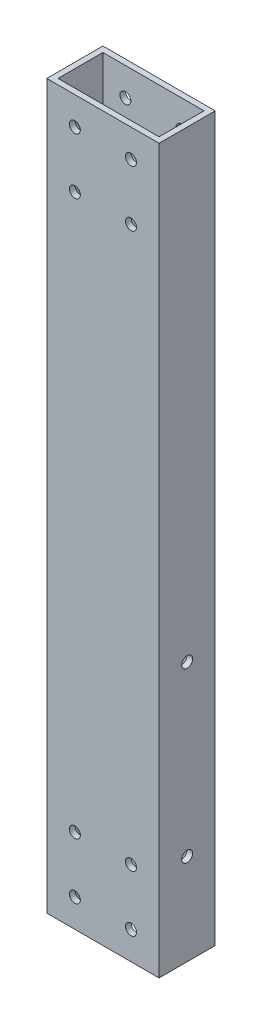
ISO-10303-21;
HEADER;
FILE_DESCRIPTION(('STEP AP214'),'2;1');
FILE_NAME('part.step','',(''),(''),'','','');
FILE_SCHEMA(('AUTOMOTIVE_DESIGN { 1 0 10303 214 1 1 1 1 }'));
ENDSEC;
DATA;
#1=APPLICATION_CONTEXT('core data for automotive mechanical design processes');
#2=APPLICATION_PROTOCOL_DEFINITION('international standard','automotive_design',2000,#1);
#3=PRODUCT_CONTEXT('',#1,'mechanical');
#4=PRODUCT('Part','Part','',(#3));
#5=PRODUCT_RELATED_PRODUCT_CATEGORY('part','',(#4));
#6=PRODUCT_DEFINITION_FORMATION('','',#4);
#7=PRODUCT_DEFINITION_CONTEXT('part definition',#1,'design');
#8=PRODUCT_DEFINITION('design','',#6,#7);
#9=PRODUCT_DEFINITION_SHAPE('','',#8);
#10=(LENGTH_UNIT() NAMED_UNIT(*) SI_UNIT(.MILLI.,.METRE.));
#11=(NAMED_UNIT(*) PLANE_ANGLE_UNIT() SI_UNIT($,.RADIAN.));
#12=(NAMED_UNIT(*) SI_UNIT($,.STERADIAN.) SOLID_ANGLE_UNIT());
#13=UNCERTAINTY_MEASURE_WITH_UNIT(LENGTH_MEASURE(1.E-05),#10,'distance_accuracy_value','');
#14=(GEOMETRIC_REPRESENTATION_CONTEXT(3) GLOBAL_UNCERTAINTY_ASSIGNED_CONTEXT((#13)) GLOBAL_UNIT_ASSIGNED_CONTEXT((#10,
#11,#12)) REPRESENTATION_CONTEXT('',''));
#15=CARTESIAN_POINT('',(0.,0.,0.));
#16=DIRECTION('',(0.,0.,1.));
#17=DIRECTION('',(1.,0.,0.));
#18=AXIS2_PLACEMENT_3D('',#15,#16,#17);
#19=CARTESIAN_POINT('',(0.,163.5125,0.));
#20=DIRECTION('',(0.,1.,0.));
#21=DIRECTION('',(0.,0.,1.));
#22=AXIS2_PLACEMENT_3D('',#19,#20,#21);
#23=PLANE('',#22);
#24=DIRECTION('',(0.,0.,-1.));
#25=VECTOR('',#24,1.);
#26=CARTESIAN_POINT('',(25.4,163.5125,12.7));
#27=LINE('',#26,#25);
#28=CARTESIAN_POINT('',(25.4,163.5125,12.7));
#29=VERTEX_POINT('',#28);
#30=CARTESIAN_POINT('',(25.4,163.5125,-12.7));
#31=VERTEX_POINT('',#30);
#32=EDGE_CURVE('E161',#29,#31,#27,.T.);
#33=ORIENTED_EDGE('',*,*,#32,.T.);
#34=DIRECTION('',(-1.,0.,0.));
#35=VECTOR('',#34,1.);
#36=CARTESIAN_POINT('',(-25.4,163.5125,-12.7));
#37=LINE('',#36,#35);
#38=CARTESIAN_POINT('',(-25.4,163.5125,-12.7));
#39=VERTEX_POINT('',#38);
#40=EDGE_CURVE('E164',#31,#39,#37,.T.);
#41=ORIENTED_EDGE('',*,*,#40,.T.);
#42=DIRECTION('',(0.,0.,1.));
#43=VECTOR('',#42,1.);
#44=CARTESIAN_POINT('',(-25.4,163.5125,12.7));
#45=LINE('',#44,#43);
#46=CARTESIAN_POINT('',(-25.4,163.5125,12.7));
#47=VERTEX_POINT('',#46);
#48=EDGE_CURVE('E167',#39,#47,#45,.T.);
#49=ORIENTED_EDGE('',*,*,#48,.T.);
#50=DIRECTION('',(1.,0.,0.));
#51=VECTOR('',#50,1.);
#52=CARTESIAN_POINT('',(-25.4,163.5125,12.7));
#53=LINE('',#52,#51);
#54=EDGE_CURVE('E169',#47,#29,#53,.T.);
#55=ORIENTED_EDGE('',*,*,#54,.T.);
#56=EDGE_LOOP('',(#33,#41,#49,#55));
#57=FACE_BOUND('',#56,.T.);
#58=DIRECTION('',(-1.,0.,0.));
#59=VECTOR('',#58,1.);
#60=CARTESIAN_POINT('',(0.,163.5125,-10.16));
#61=LINE('',#60,#59);
#62=CARTESIAN_POINT('',(22.86,163.5125,-10.16));
#63=VERTEX_POINT('',#62);
#64=CARTESIAN_POINT('',(-22.86,163.5125,-10.16));
#65=VERTEX_POINT('',#64);
#66=EDGE_CURVE('E131',#63,#65,#61,.T.);
#67=ORIENTED_EDGE('',*,*,#66,.F.);
#68=DIRECTION('',(0.,0.,-1.));
#69=VECTOR('',#68,1.);
#70=CARTESIAN_POINT('',(22.86,163.5125,0.));
#71=LINE('',#70,#69);
#72=CARTESIAN_POINT('',(22.86,163.5125,10.16));
#73=VERTEX_POINT('',#72);
#74=EDGE_CURVE('E123',#73,#63,#71,.T.);
#75=ORIENTED_EDGE('',*,*,#74,.F.);
#76=DIRECTION('',(1.,0.,0.));
#77=VECTOR('',#76,1.);
#78=CARTESIAN_POINT('',(0.,163.5125,10.16));
#79=LINE('',#78,#77);
#80=CARTESIAN_POINT('',(-22.86,163.5125,10.16));
#81=VERTEX_POINT('',#80);
#82=EDGE_CURVE('E145',#81,#73,#79,.T.);
#83=ORIENTED_EDGE('',*,*,#82,.F.);
#84=DIRECTION('',(0.,0.,1.));
#85=VECTOR('',#84,1.);
#86=CARTESIAN_POINT('',(-22.86,163.5125,0.));
#87=LINE('',#86,#85);
#88=EDGE_CURVE('E143',#65,#81,#87,.T.);
#89=ORIENTED_EDGE('',*,*,#88,.F.);
#90=EDGE_LOOP('',(#67,#75,#83,#89));
#91=FACE_BOUND('',#90,.T.);
#92=ADVANCED_FACE('F56',(#57,#91),#23,.T.);
#93=CARTESIAN_POINT('',(0.,-163.5125,0.));
#94=DIRECTION('',(0.,1.,0.));
#95=DIRECTION('',(0.,0.,1.));
#96=AXIS2_PLACEMENT_3D('',#93,#94,#95);
#97=PLANE('',#96);
#98=DIRECTION('',(0.,0.,-1.));
#99=VECTOR('',#98,1.);
#100=CARTESIAN_POINT('',(25.4,-163.5125,12.7));
#101=LINE('',#100,#99);
#102=CARTESIAN_POINT('',(25.4,-163.5125,12.7));
#103=VERTEX_POINT('',#102);
#104=CARTESIAN_POINT('',(25.4,-163.5125,-12.7));
#105=VERTEX_POINT('',#104);
#106=EDGE_CURVE('E139',#103,#105,#101,.T.);
#107=ORIENTED_EDGE('',*,*,#106,.F.);
#108=DIRECTION('',(1.,0.,0.));
#109=VECTOR('',#108,1.);
#110=CARTESIAN_POINT('',(-25.4,-163.5125,12.7));
#111=LINE('',#110,#109);
#112=CARTESIAN_POINT('',(-25.4,-163.5125,12.7));
#113=VERTEX_POINT('',#112);
#114=EDGE_CURVE('E165',#113,#103,#111,.T.);
#115=ORIENTED_EDGE('',*,*,#114,.F.);
#116=DIRECTION('',(0.,0.,1.));
#117=VECTOR('',#116,1.);
#118=CARTESIAN_POINT('',(-25.4,-163.5125,12.7));
#119=LINE('',#118,#117);
#120=CARTESIAN_POINT('',(-25.4,-163.5125,-12.7));
#121=VERTEX_POINT('',#120);
#122=EDGE_CURVE('E176',#121,#113,#119,.T.);
#123=ORIENTED_EDGE('',*,*,#122,.F.);
#124=DIRECTION('',(-1.,0.,0.));
#125=VECTOR('',#124,1.);
#126=CARTESIAN_POINT('',(-25.4,-163.5125,-12.7));
#127=LINE('',#126,#125);
#128=EDGE_CURVE('E174',#105,#121,#127,.T.);
#129=ORIENTED_EDGE('',*,*,#128,.F.);
#130=EDGE_LOOP('',(#107,#115,#123,#129));
#131=FACE_BOUND('',#130,.T.);
#132=DIRECTION('',(0.,0.,-1.));
#133=VECTOR('',#132,1.);
#134=CARTESIAN_POINT('',(22.86,-163.5125,0.));
#135=LINE('',#134,#133);
#136=CARTESIAN_POINT('',(22.86,-163.5125,10.16));
#137=VERTEX_POINT('',#136);
#138=CARTESIAN_POINT('',(22.86,-163.5125,-10.16));
#139=VERTEX_POINT('',#138);
#140=EDGE_CURVE('E81',#137,#139,#135,.T.);
#141=ORIENTED_EDGE('',*,*,#140,.T.);
#142=DIRECTION('',(-1.,0.,0.));
#143=VECTOR('',#142,1.);
#144=CARTESIAN_POINT('',(0.,-163.5125,-10.16));
#145=LINE('',#144,#143);
#146=CARTESIAN_POINT('',(-22.86,-163.5125,-10.16));
#147=VERTEX_POINT('',#146);
#148=EDGE_CURVE('E138',#139,#147,#145,.T.);
#149=ORIENTED_EDGE('',*,*,#148,.T.);
#150=DIRECTION('',(0.,0.,1.));
#151=VECTOR('',#150,1.);
#152=CARTESIAN_POINT('',(-22.86,-163.5125,0.));
#153=LINE('',#152,#151);
#154=CARTESIAN_POINT('',(-22.86,-163.5125,10.16));
#155=VERTEX_POINT('',#154);
#156=EDGE_CURVE('E153',#147,#155,#153,.T.);
#157=ORIENTED_EDGE('',*,*,#156,.T.);
#158=DIRECTION('',(1.,0.,0.));
#159=VECTOR('',#158,1.);
#160=CARTESIAN_POINT('',(0.,-163.5125,10.16));
#161=LINE('',#160,#159);
#162=EDGE_CURVE('E132',#155,#137,#161,.T.);
#163=ORIENTED_EDGE('',*,*,#162,.T.);
#164=EDGE_LOOP('',(#141,#149,#157,#163));
#165=FACE_BOUND('',#164,.T.);
#166=ADVANCED_FACE('F252',(#131,#165),#97,.F.);
#167=CARTESIAN_POINT('',(25.4,163.5125,12.7));
#168=DIRECTION('',(-1.,0.,0.));
#169=DIRECTION('',(0.,0.,1.));
#170=AXIS2_PLACEMENT_3D('',#167,#168,#169);
#171=PLANE('',#170);
#172=CARTESIAN_POINT('',(25.4,-46.0374999999954,0.));
#173=DIRECTION('',(1.,0.,0.));
#174=DIRECTION('',(0.,0.,-1.));
#175=AXIS2_PLACEMENT_3D('',#172,#173,#174);
#176=CIRCLE('',#175,2.4765);
#177=CARTESIAN_POINT('',(25.4,-46.0374999999954,-2.47649999999999));
#178=VERTEX_POINT('',#177);
#179=EDGE_CURVE('E446',#178,#178,#176,.T.);
#180=ORIENTED_EDGE('',*,*,#179,.F.);
#181=EDGE_LOOP('',(#180));
#182=FACE_BOUND('',#181,.T.);
#183=CARTESIAN_POINT('',(25.4,-122.237499999995,0.));
#184=DIRECTION('',(1.,0.,0.));
#185=DIRECTION('',(0.,0.,-1.));
#186=AXIS2_PLACEMENT_3D('',#183,#184,#185);
#187=CIRCLE('',#186,2.47649999999999);
#188=CARTESIAN_POINT('',(25.4,-122.237499999995,-2.47649999999998));
#189=VERTEX_POINT('',#188);
#190=EDGE_CURVE('E440',#189,#189,#187,.T.);
#191=ORIENTED_EDGE('',*,*,#190,.F.);
#192=EDGE_LOOP('',(#191));
#193=FACE_BOUND('',#192,.T.);
#194=ORIENTED_EDGE('',*,*,#106,.T.);
#195=DIRECTION('',(0.,-1.,0.));
#196=VECTOR('',#195,1.);
#197=CARTESIAN_POINT('',(25.4,163.5125,-12.7));
#198=LINE('',#197,#196);
#199=EDGE_CURVE('E12',#31,#105,#198,.T.);
#200=ORIENTED_EDGE('',*,*,#199,.F.);
#201=ORIENTED_EDGE('',*,*,#32,.F.);
#202=DIRECTION('',(0.,-1.,0.));
#203=VECTOR('',#202,1.);
#204=CARTESIAN_POINT('',(25.4,163.5125,12.7));
#205=LINE('',#204,#203);
#206=EDGE_CURVE('E171',#29,#103,#205,.T.);
#207=ORIENTED_EDGE('',*,*,#206,.T.);
#208=EDGE_LOOP('',(#194,#200,#201,#207));
#209=FACE_BOUND('',#208,.T.);
#210=ADVANCED_FACE('F58',(#182,#193,#209),#171,.F.);
#211=CARTESIAN_POINT('',(-25.4,163.5125,-12.7));
#212=DIRECTION('',(0.,0.,1.));
#213=DIRECTION('',(1.,0.,0.));
#214=AXIS2_PLACEMENT_3D('',#211,#212,#213);
#215=PLANE('',#214);
#216=CARTESIAN_POINT('',(12.7,150.8125,-12.7));
#217=DIRECTION('',(0.,0.,1.));
#218=DIRECTION('',(1.,0.,0.));
#219=AXIS2_PLACEMENT_3D('',#216,#217,#218);
#220=CIRCLE('',#219,2.47650000000001);
#221=CARTESIAN_POINT('',(15.1765,150.8125,-12.7));
#222=VERTEX_POINT('',#221);
#223=EDGE_CURVE('E289',#222,#222,#220,.T.);
#224=ORIENTED_EDGE('',*,*,#223,.T.);
#225=EDGE_LOOP('',(#224));
#226=FACE_BOUND('',#225,.T.);
#227=CARTESIAN_POINT('',(-12.7,-150.8125,-12.7));
#228=DIRECTION('',(0.,0.,1.));
#229=DIRECTION('',(1.,0.,0.));
#230=AXIS2_PLACEMENT_3D('',#227,#228,#229);
#231=CIRCLE('',#230,2.47650000000001);
#232=CARTESIAN_POINT('',(-10.2235,-150.8125,-12.7));
#233=VERTEX_POINT('',#232);
#234=EDGE_CURVE('E293',#233,#233,#231,.T.);
#235=ORIENTED_EDGE('',*,*,#234,.T.);
#236=EDGE_LOOP('',(#235));
#237=FACE_BOUND('',#236,.T.);
#238=CARTESIAN_POINT('',(12.7,-150.8125,-12.7));
#239=DIRECTION('',(0.,0.,1.));
#240=DIRECTION('',(1.,0.,0.));
#241=AXIS2_PLACEMENT_3D('',#238,#239,#240);
#242=CIRCLE('',#241,2.47650000000001);
#243=CARTESIAN_POINT('',(15.1765,-150.8125,-12.7));
#244=VERTEX_POINT('',#243);
#245=EDGE_CURVE('E297',#244,#244,#242,.T.);
#246=ORIENTED_EDGE('',*,*,#245,.T.);
#247=EDGE_LOOP('',(#246));
#248=FACE_BOUND('',#247,.T.);
#249=CARTESIAN_POINT('',(12.7,-125.4125,-12.7));
#250=DIRECTION('',(0.,0.,1.));
#251=DIRECTION('',(1.,0.,0.));
#252=AXIS2_PLACEMENT_3D('',#249,#250,#251);
#253=CIRCLE('',#252,2.4765);
#254=CARTESIAN_POINT('',(15.1765,-125.4125,-12.7));
#255=VERTEX_POINT('',#254);
#256=EDGE_CURVE('E301',#255,#255,#253,.T.);
#257=ORIENTED_EDGE('',*,*,#256,.T.);
#258=EDGE_LOOP('',(#257));
#259=FACE_BOUND('',#258,.T.);
#260=CARTESIAN_POINT('',(12.7,125.4125,-12.7));
#261=DIRECTION('',(0.,0.,1.));
#262=DIRECTION('',(1.,0.,0.));
#263=AXIS2_PLACEMENT_3D('',#260,#261,#262);
#264=CIRCLE('',#263,2.47650000000001);
#265=CARTESIAN_POINT('',(15.1765,125.4125,-12.7));
#266=VERTEX_POINT('',#265);
#267=EDGE_CURVE('E305',#266,#266,#264,.T.);
#268=ORIENTED_EDGE('',*,*,#267,.T.);
#269=EDGE_LOOP('',(#268));
#270=FACE_BOUND('',#269,.T.);
#271=CARTESIAN_POINT('',(-12.7,125.4125,-12.7));
#272=DIRECTION('',(0.,0.,1.));
#273=DIRECTION('',(1.,0.,0.));
#274=AXIS2_PLACEMENT_3D('',#271,#272,#273);
#275=CIRCLE('',#274,2.47650000000001);
#276=CARTESIAN_POINT('',(-10.2235,125.4125,-12.7));
#277=VERTEX_POINT('',#276);
#278=EDGE_CURVE('E309',#277,#277,#275,.T.);
#279=ORIENTED_EDGE('',*,*,#278,.T.);
#280=EDGE_LOOP('',(#279));
#281=FACE_BOUND('',#280,.T.);
#282=CARTESIAN_POINT('',(-12.7,150.8125,-12.7));
#283=DIRECTION('',(0.,0.,1.));
#284=DIRECTION('',(1.,0.,0.));
#285=AXIS2_PLACEMENT_3D('',#282,#283,#284);
#286=CIRCLE('',#285,2.47650000000001);
#287=CARTESIAN_POINT('',(-10.2235,150.8125,-12.7));
#288=VERTEX_POINT('',#287);
#289=EDGE_CURVE('E313',#288,#288,#286,.T.);
#290=ORIENTED_EDGE('',*,*,#289,.T.);
#291=EDGE_LOOP('',(#290));
#292=FACE_BOUND('',#291,.T.);
#293=CARTESIAN_POINT('',(-12.7,-125.4125,-12.7));
#294=DIRECTION('',(0.,0.,1.));
#295=DIRECTION('',(1.,0.,0.));
#296=AXIS2_PLACEMENT_3D('',#293,#294,#295);
#297=CIRCLE('',#296,2.47649999999999);
#298=CARTESIAN_POINT('',(-10.2235,-125.4125,-12.7));
#299=VERTEX_POINT('',#298);
#300=EDGE_CURVE('E190',#299,#299,#297,.T.);
#301=ORIENTED_EDGE('',*,*,#300,.T.);
#302=EDGE_LOOP('',(#301));
#303=FACE_BOUND('',#302,.T.);
#304=ORIENTED_EDGE('',*,*,#128,.T.);
#305=DIRECTION('',(0.,-1.,0.));
#306=VECTOR('',#305,1.);
#307=CARTESIAN_POINT('',(-25.4,163.5125,-12.7));
#308=LINE('',#307,#306);
#309=EDGE_CURVE('E65',#39,#121,#308,.T.);
#310=ORIENTED_EDGE('',*,*,#309,.F.);
#311=ORIENTED_EDGE('',*,*,#40,.F.);
#312=ORIENTED_EDGE('',*,*,#199,.T.);
#313=EDGE_LOOP('',(#304,#310,#311,#312));
#314=FACE_BOUND('',#313,.T.);
#315=ADVANCED_FACE('F277',(#226,#237,#248,#259,#270,#281,#292,#303,#314),#215,.F.);
#316=CARTESIAN_POINT('',(-25.4,163.5125,12.7));
#317=DIRECTION('',(1.,0.,0.));
#318=DIRECTION('',(0.,0.,-1.));
#319=AXIS2_PLACEMENT_3D('',#316,#317,#318);
#320=PLANE('',#319);
#321=ORIENTED_EDGE('',*,*,#122,.T.);
#322=DIRECTION('',(0.,-1.,0.));
#323=VECTOR('',#322,1.);
#324=CARTESIAN_POINT('',(-25.4,163.5125,12.7));
#325=LINE('',#324,#323);
#326=EDGE_CURVE('E181',#47,#113,#325,.T.);
#327=ORIENTED_EDGE('',*,*,#326,.F.);
#328=ORIENTED_EDGE('',*,*,#48,.F.);
#329=ORIENTED_EDGE('',*,*,#309,.T.);
#330=EDGE_LOOP('',(#321,#327,#328,#329));
#331=FACE_BOUND('',#330,.T.);
#332=ADVANCED_FACE('F274',(#331),#320,.F.);
#333=CARTESIAN_POINT('',(-25.4,163.5125,12.7));
#334=DIRECTION('',(0.,0.,-1.));
#335=DIRECTION('',(-1.,0.,0.));
#336=AXIS2_PLACEMENT_3D('',#333,#334,#335);
#337=PLANE('',#336);
#338=CARTESIAN_POINT('',(12.7,150.8125,12.7));
#339=DIRECTION('',(0.,0.,1.));
#340=DIRECTION('',(1.,0.,0.));
#341=AXIS2_PLACEMENT_3D('',#338,#339,#340);
#342=CIRCLE('',#341,2.47650000000001);
#343=CARTESIAN_POINT('',(15.1765,150.8125,12.7));
#344=VERTEX_POINT('',#343);
#345=EDGE_CURVE('E421',#344,#344,#342,.T.);
#346=ORIENTED_EDGE('',*,*,#345,.F.);
#347=EDGE_LOOP('',(#346));
#348=FACE_BOUND('',#347,.T.);
#349=CARTESIAN_POINT('',(-12.7,-150.8125,12.7));
#350=DIRECTION('',(0.,0.,1.));
#351=DIRECTION('',(1.,0.,0.));
#352=AXIS2_PLACEMENT_3D('',#349,#350,#351);
#353=CIRCLE('',#352,2.47650000000001);
#354=CARTESIAN_POINT('',(-10.2235,-150.8125,12.7));
#355=VERTEX_POINT('',#354);
#356=EDGE_CURVE('E420',#355,#355,#353,.T.);
#357=ORIENTED_EDGE('',*,*,#356,.F.);
#358=EDGE_LOOP('',(#357));
#359=FACE_BOUND('',#358,.T.);
#360=CARTESIAN_POINT('',(12.7,-150.8125,12.7));
#361=DIRECTION('',(0.,0.,1.));
#362=DIRECTION('',(1.,0.,0.));
#363=AXIS2_PLACEMENT_3D('',#360,#361,#362);
#364=CIRCLE('',#363,2.47650000000001);
#365=CARTESIAN_POINT('',(15.1765,-150.8125,12.7));
#366=VERTEX_POINT('',#365);
#367=EDGE_CURVE('E412',#366,#366,#364,.T.);
#368=ORIENTED_EDGE('',*,*,#367,.F.);
#369=EDGE_LOOP('',(#368));
#370=FACE_BOUND('',#369,.T.);
#371=CARTESIAN_POINT('',(12.7,-125.4125,12.7));
#372=DIRECTION('',(0.,0.,1.));
#373=DIRECTION('',(1.,0.,0.));
#374=AXIS2_PLACEMENT_3D('',#371,#372,#373);
#375=CIRCLE('',#374,2.4765);
#376=CARTESIAN_POINT('',(15.1765,-125.4125,12.7));
#377=VERTEX_POINT('',#376);
#378=EDGE_CURVE('E411',#377,#377,#375,.T.);
#379=ORIENTED_EDGE('',*,*,#378,.F.);
#380=EDGE_LOOP('',(#379));
#381=FACE_BOUND('',#380,.T.);
#382=CARTESIAN_POINT('',(12.7,125.4125,12.7));
#383=DIRECTION('',(0.,0.,1.));
#384=DIRECTION('',(1.,0.,0.));
#385=AXIS2_PLACEMENT_3D('',#382,#383,#384);
#386=CIRCLE('',#385,2.47650000000001);
#387=CARTESIAN_POINT('',(15.1765,125.4125,12.7));
#388=VERTEX_POINT('',#387);
#389=EDGE_CURVE('E434',#388,#388,#386,.T.);
#390=ORIENTED_EDGE('',*,*,#389,.F.);
#391=EDGE_LOOP('',(#390));
#392=FACE_BOUND('',#391,.T.);
#393=CARTESIAN_POINT('',(-12.7,125.4125,12.7));
#394=DIRECTION('',(0.,0.,1.));
#395=DIRECTION('',(1.,0.,0.));
#396=AXIS2_PLACEMENT_3D('',#393,#394,#395);
#397=CIRCLE('',#396,2.47650000000001);
#398=CARTESIAN_POINT('',(-10.2235,125.4125,12.7));
#399=VERTEX_POINT('',#398);
#400=EDGE_CURVE('E428',#399,#399,#397,.T.);
#401=ORIENTED_EDGE('',*,*,#400,.F.);
#402=EDGE_LOOP('',(#401));
#403=FACE_BOUND('',#402,.T.);
#404=CARTESIAN_POINT('',(-12.7,150.8125,12.7));
#405=DIRECTION('',(0.,0.,1.));
#406=DIRECTION('',(1.,0.,0.));
#407=AXIS2_PLACEMENT_3D('',#404,#405,#406);
#408=CIRCLE('',#407,2.47650000000001);
#409=CARTESIAN_POINT('',(-10.2235,150.8125,12.7));
#410=VERTEX_POINT('',#409);
#411=EDGE_CURVE('E429',#410,#410,#408,.T.);
#412=ORIENTED_EDGE('',*,*,#411,.F.);
#413=EDGE_LOOP('',(#412));
#414=FACE_BOUND('',#413,.T.);
#415=CARTESIAN_POINT('',(-12.7,-125.4125,12.7));
#416=DIRECTION('',(0.,0.,1.));
#417=DIRECTION('',(1.,0.,0.));
#418=AXIS2_PLACEMENT_3D('',#415,#416,#417);
#419=CIRCLE('',#418,2.47649999999999);
#420=CARTESIAN_POINT('',(-10.2235,-125.4125,12.7));
#421=VERTEX_POINT('',#420);
#422=EDGE_CURVE('E330',#421,#421,#419,.T.);
#423=ORIENTED_EDGE('',*,*,#422,.F.);
#424=EDGE_LOOP('',(#423));
#425=FACE_BOUND('',#424,.T.);
#426=ORIENTED_EDGE('',*,*,#114,.T.);
#427=ORIENTED_EDGE('',*,*,#206,.F.);
#428=ORIENTED_EDGE('',*,*,#54,.F.);
#429=ORIENTED_EDGE('',*,*,#326,.T.);
#430=EDGE_LOOP('',(#426,#427,#428,#429));
#431=FACE_BOUND('',#430,.T.);
#432=ADVANCED_FACE('F271',(#348,#359,#370,#381,#392,#403,#414,#425,#431),#337,.F.);
#433=CARTESIAN_POINT('',(22.86,163.5125,0.));
#434=DIRECTION('',(-1.,0.,0.));
#435=DIRECTION('',(0.,0.,1.));
#436=AXIS2_PLACEMENT_3D('',#433,#434,#435);
#437=PLANE('',#436);
#438=CARTESIAN_POINT('',(22.86,-46.0374999999954,0.));
#439=DIRECTION('',(1.,0.,0.));
#440=DIRECTION('',(0.,0.,-1.));
#441=AXIS2_PLACEMENT_3D('',#438,#439,#440);
#442=CIRCLE('',#441,2.4765);
#443=CARTESIAN_POINT('',(22.86,-46.0374999999954,-2.47649999999999));
#444=VERTEX_POINT('',#443);
#445=EDGE_CURVE('E432',#444,#444,#442,.T.);
#446=ORIENTED_EDGE('',*,*,#445,.T.);
#447=EDGE_LOOP('',(#446));
#448=FACE_BOUND('',#447,.T.);
#449=CARTESIAN_POINT('',(22.86,-122.237499999995,0.));
#450=DIRECTION('',(1.,0.,0.));
#451=DIRECTION('',(0.,0.,-1.));
#452=AXIS2_PLACEMENT_3D('',#449,#450,#451);
#453=CIRCLE('',#452,2.47649999999999);
#454=CARTESIAN_POINT('',(22.86,-122.237499999995,-2.47649999999998));
#455=VERTEX_POINT('',#454);
#456=EDGE_CURVE('E443',#455,#455,#453,.T.);
#457=ORIENTED_EDGE('',*,*,#456,.T.);
#458=EDGE_LOOP('',(#457));
#459=FACE_BOUND('',#458,.T.);
#460=ORIENTED_EDGE('',*,*,#140,.F.);
#461=DIRECTION('',(0.,-1.,0.));
#462=VECTOR('',#461,1.);
#463=CARTESIAN_POINT('',(22.86,163.5125,10.16));
#464=LINE('',#463,#462);
#465=EDGE_CURVE('E127',#73,#137,#464,.T.);
#466=ORIENTED_EDGE('',*,*,#465,.F.);
#467=ORIENTED_EDGE('',*,*,#74,.T.);
#468=DIRECTION('',(0.,-1.,0.));
#469=VECTOR('',#468,1.);
#470=CARTESIAN_POINT('',(22.86,163.5125,-10.16));
#471=LINE('',#470,#469);
#472=EDGE_CURVE('E126',#63,#139,#471,.T.);
#473=ORIENTED_EDGE('',*,*,#472,.T.);
#474=EDGE_LOOP('',(#460,#466,#467,#473));
#475=FACE_BOUND('',#474,.T.);
#476=ADVANCED_FACE('F125',(#448,#459,#475),#437,.T.);
#477=CARTESIAN_POINT('',(0.,163.5125,-10.16));
#478=DIRECTION('',(0.,0.,1.));
#479=DIRECTION('',(1.,0.,0.));
#480=AXIS2_PLACEMENT_3D('',#477,#478,#479);
#481=PLANE('',#480);
#482=CARTESIAN_POINT('',(12.7,150.8125,-10.16));
#483=DIRECTION('',(0.,0.,1.));
#484=DIRECTION('',(1.,0.,0.));
#485=AXIS2_PLACEMENT_3D('',#482,#483,#484);
#486=CIRCLE('',#485,2.47650000000001);
#487=CARTESIAN_POINT('',(15.1765,150.8125,-10.16));
#488=VERTEX_POINT('',#487);
#489=EDGE_CURVE('E151',#488,#488,#486,.T.);
#490=ORIENTED_EDGE('',*,*,#489,.F.);
#491=EDGE_LOOP('',(#490));
#492=FACE_BOUND('',#491,.T.);
#493=CARTESIAN_POINT('',(-12.7,-150.8125,-10.16));
#494=DIRECTION('',(0.,0.,1.));
#495=DIRECTION('',(1.,0.,0.));
#496=AXIS2_PLACEMENT_3D('',#493,#494,#495);
#497=CIRCLE('',#496,2.47650000000001);
#498=CARTESIAN_POINT('',(-10.2235,-150.8125,-10.16));
#499=VERTEX_POINT('',#498);
#500=EDGE_CURVE('E212',#499,#499,#497,.T.);
#501=ORIENTED_EDGE('',*,*,#500,.F.);
#502=EDGE_LOOP('',(#501));
#503=FACE_BOUND('',#502,.T.);
#504=CARTESIAN_POINT('',(12.7,-150.8125,-10.16));
#505=DIRECTION('',(0.,0.,1.));
#506=DIRECTION('',(1.,0.,0.));
#507=AXIS2_PLACEMENT_3D('',#504,#505,#506);
#508=CIRCLE('',#507,2.47650000000001);
#509=CARTESIAN_POINT('',(15.1765,-150.8125,-10.16));
#510=VERTEX_POINT('',#509);
#511=EDGE_CURVE('E209',#510,#510,#508,.T.);
#512=ORIENTED_EDGE('',*,*,#511,.F.);
#513=EDGE_LOOP('',(#512));
#514=FACE_BOUND('',#513,.T.);
#515=CARTESIAN_POINT('',(12.7,-125.4125,-10.16));
#516=DIRECTION('',(0.,0.,1.));
#517=DIRECTION('',(1.,0.,0.));
#518=AXIS2_PLACEMENT_3D('',#515,#516,#517);
#519=CIRCLE('',#518,2.4765);
#520=CARTESIAN_POINT('',(15.1765,-125.4125,-10.16));
#521=VERTEX_POINT('',#520);
#522=EDGE_CURVE('E206',#521,#521,#519,.T.);
#523=ORIENTED_EDGE('',*,*,#522,.F.);
#524=EDGE_LOOP('',(#523));
#525=FACE_BOUND('',#524,.T.);
#526=CARTESIAN_POINT('',(12.7,125.4125,-10.16));
#527=DIRECTION('',(0.,0.,1.));
#528=DIRECTION('',(1.,0.,0.));
#529=AXIS2_PLACEMENT_3D('',#526,#527,#528);
#530=CIRCLE('',#529,2.47650000000001);
#531=CARTESIAN_POINT('',(15.1765,125.4125,-10.16));
#532=VERTEX_POINT('',#531);
#533=EDGE_CURVE('E202',#532,#532,#530,.T.);
#534=ORIENTED_EDGE('',*,*,#533,.F.);
#535=EDGE_LOOP('',(#534));
#536=FACE_BOUND('',#535,.T.);
#537=CARTESIAN_POINT('',(-12.7,125.4125,-10.16));
#538=DIRECTION('',(0.,0.,1.));
#539=DIRECTION('',(1.,0.,0.));
#540=AXIS2_PLACEMENT_3D('',#537,#538,#539);
#541=CIRCLE('',#540,2.47650000000001);
#542=CARTESIAN_POINT('',(-10.2235,125.4125,-10.16));
#543=VERTEX_POINT('',#542);
#544=EDGE_CURVE('E198',#543,#543,#541,.T.);
#545=ORIENTED_EDGE('',*,*,#544,.F.);
#546=EDGE_LOOP('',(#545));
#547=FACE_BOUND('',#546,.T.);
#548=CARTESIAN_POINT('',(-12.7,150.8125,-10.16));
#549=DIRECTION('',(0.,0.,1.));
#550=DIRECTION('',(1.,0.,0.));
#551=AXIS2_PLACEMENT_3D('',#548,#549,#550);
#552=CIRCLE('',#551,2.47650000000001);
#553=CARTESIAN_POINT('',(-10.2235,150.8125,-10.16));
#554=VERTEX_POINT('',#553);
#555=EDGE_CURVE('E194',#554,#554,#552,.T.);
#556=ORIENTED_EDGE('',*,*,#555,.F.);
#557=EDGE_LOOP('',(#556));
#558=FACE_BOUND('',#557,.T.);
#559=CARTESIAN_POINT('',(-12.7,-125.4125,-10.16));
#560=DIRECTION('',(0.,0.,1.));
#561=DIRECTION('',(1.,0.,0.));
#562=AXIS2_PLACEMENT_3D('',#559,#560,#561);
#563=CIRCLE('',#562,2.47649999999999);
#564=CARTESIAN_POINT('',(-10.2235,-125.4125,-10.16));
#565=VERTEX_POINT('',#564);
#566=EDGE_CURVE('E189',#565,#565,#563,.T.);
#567=ORIENTED_EDGE('',*,*,#566,.F.);
#568=EDGE_LOOP('',(#567));
#569=FACE_BOUND('',#568,.T.);
#570=ORIENTED_EDGE('',*,*,#148,.F.);
#571=ORIENTED_EDGE('',*,*,#472,.F.);
#572=ORIENTED_EDGE('',*,*,#66,.T.);
#573=DIRECTION('',(0.,-1.,0.));
#574=VECTOR('',#573,1.);
#575=CARTESIAN_POINT('',(-22.86,163.5125,-10.16));
#576=LINE('',#575,#574);
#577=EDGE_CURVE('E140',#65,#147,#576,.T.);
#578=ORIENTED_EDGE('',*,*,#577,.T.);
#579=EDGE_LOOP('',(#570,#571,#572,#578));
#580=FACE_BOUND('',#579,.T.);
#581=ADVANCED_FACE('F135',(#492,#503,#514,#525,#536,#547,#558,#569,#580),#481,.T.);
#582=CARTESIAN_POINT('',(-22.86,163.5125,0.));
#583=DIRECTION('',(1.,0.,0.));
#584=DIRECTION('',(0.,0.,-1.));
#585=AXIS2_PLACEMENT_3D('',#582,#583,#584);
#586=PLANE('',#585);
#587=ORIENTED_EDGE('',*,*,#156,.F.);
#588=ORIENTED_EDGE('',*,*,#577,.F.);
#589=ORIENTED_EDGE('',*,*,#88,.T.);
#590=DIRECTION('',(0.,-1.,0.));
#591=VECTOR('',#590,1.);
#592=CARTESIAN_POINT('',(-22.86,163.5125,10.16));
#593=LINE('',#592,#591);
#594=EDGE_CURVE('E73',#81,#155,#593,.T.);
#595=ORIENTED_EDGE('',*,*,#594,.T.);
#596=EDGE_LOOP('',(#587,#588,#589,#595));
#597=FACE_BOUND('',#596,.T.);
#598=ADVANCED_FACE('F236',(#597),#586,.T.);
#599=CARTESIAN_POINT('',(0.,163.5125,10.16));
#600=DIRECTION('',(0.,0.,-1.));
#601=DIRECTION('',(-1.,0.,0.));
#602=AXIS2_PLACEMENT_3D('',#599,#600,#601);
#603=PLANE('',#602);
#604=CARTESIAN_POINT('',(12.7,150.8125,10.16));
#605=DIRECTION('',(0.,0.,-1.));
#606=DIRECTION('',(-1.,0.,0.));
#607=AXIS2_PLACEMENT_3D('',#604,#605,#606);
#608=CIRCLE('',#607,2.47650000000001);
#609=CARTESIAN_POINT('',(10.2235,150.8125,10.16));
#610=VERTEX_POINT('',#609);
#611=EDGE_CURVE('E60',#610,#610,#608,.T.);
#612=ORIENTED_EDGE('',*,*,#611,.F.);
#613=EDGE_LOOP('',(#612));
#614=FACE_BOUND('',#613,.T.);
#615=CARTESIAN_POINT('',(-12.7,-150.8125,10.16));
#616=DIRECTION('',(0.,0.,-1.));
#617=DIRECTION('',(-1.,0.,0.));
#618=AXIS2_PLACEMENT_3D('',#615,#616,#617);
#619=CIRCLE('',#618,2.47650000000001);
#620=CARTESIAN_POINT('',(-15.1765,-150.8125,10.16));
#621=VERTEX_POINT('',#620);
#622=EDGE_CURVE('E210',#621,#621,#619,.T.);
#623=ORIENTED_EDGE('',*,*,#622,.F.);
#624=EDGE_LOOP('',(#623));
#625=FACE_BOUND('',#624,.T.);
#626=CARTESIAN_POINT('',(12.7,-150.8125,10.16));
#627=DIRECTION('',(0.,0.,-1.));
#628=DIRECTION('',(-1.,0.,0.));
#629=AXIS2_PLACEMENT_3D('',#626,#627,#628);
#630=CIRCLE('',#629,2.47650000000001);
#631=CARTESIAN_POINT('',(10.2235,-150.8125,10.16));
#632=VERTEX_POINT('',#631);
#633=EDGE_CURVE('E207',#632,#632,#630,.T.);
#634=ORIENTED_EDGE('',*,*,#633,.F.);
#635=EDGE_LOOP('',(#634));
#636=FACE_BOUND('',#635,.T.);
#637=CARTESIAN_POINT('',(12.7,-125.4125,10.16));
#638=DIRECTION('',(0.,0.,-1.));
#639=DIRECTION('',(-1.,0.,0.));
#640=AXIS2_PLACEMENT_3D('',#637,#638,#639);
#641=CIRCLE('',#640,2.4765);
#642=CARTESIAN_POINT('',(10.2235,-125.4125,10.16));
#643=VERTEX_POINT('',#642);
#644=EDGE_CURVE('E203',#643,#643,#641,.T.);
#645=ORIENTED_EDGE('',*,*,#644,.F.);
#646=EDGE_LOOP('',(#645));
#647=FACE_BOUND('',#646,.T.);
#648=CARTESIAN_POINT('',(12.7,125.4125,10.16));
#649=DIRECTION('',(0.,0.,-1.));
#650=DIRECTION('',(-1.,0.,0.));
#651=AXIS2_PLACEMENT_3D('',#648,#649,#650);
#652=CIRCLE('',#651,2.47650000000001);
#653=CARTESIAN_POINT('',(10.2235,125.4125,10.16));
#654=VERTEX_POINT('',#653);
#655=EDGE_CURVE('E199',#654,#654,#652,.T.);
#656=ORIENTED_EDGE('',*,*,#655,.F.);
#657=EDGE_LOOP('',(#656));
#658=FACE_BOUND('',#657,.T.);
#659=CARTESIAN_POINT('',(-12.7,125.4125,10.16));
#660=DIRECTION('',(0.,0.,-1.));
#661=DIRECTION('',(-1.,0.,0.));
#662=AXIS2_PLACEMENT_3D('',#659,#660,#661);
#663=CIRCLE('',#662,2.47650000000001);
#664=CARTESIAN_POINT('',(-15.1765,125.4125,10.16));
#665=VERTEX_POINT('',#664);
#666=EDGE_CURVE('E195',#665,#665,#663,.T.);
#667=ORIENTED_EDGE('',*,*,#666,.F.);
#668=EDGE_LOOP('',(#667));
#669=FACE_BOUND('',#668,.T.);
#670=CARTESIAN_POINT('',(-12.7,150.8125,10.16));
#671=DIRECTION('',(0.,0.,-1.));
#672=DIRECTION('',(-1.,0.,0.));
#673=AXIS2_PLACEMENT_3D('',#670,#671,#672);
#674=CIRCLE('',#673,2.47650000000001);
#675=CARTESIAN_POINT('',(-15.1765,150.8125,10.16));
#676=VERTEX_POINT('',#675);
#677=EDGE_CURVE('E191',#676,#676,#674,.T.);
#678=ORIENTED_EDGE('',*,*,#677,.F.);
#679=EDGE_LOOP('',(#678));
#680=FACE_BOUND('',#679,.T.);
#681=CARTESIAN_POINT('',(-12.7,-125.4125,10.16));
#682=DIRECTION('',(0.,0.,-1.));
#683=DIRECTION('',(-1.,0.,0.));
#684=AXIS2_PLACEMENT_3D('',#681,#682,#683);
#685=CIRCLE('',#684,2.47649999999999);
#686=CARTESIAN_POINT('',(-15.1765,-125.4125,10.16));
#687=VERTEX_POINT('',#686);
#688=EDGE_CURVE('E186',#687,#687,#685,.T.);
#689=ORIENTED_EDGE('',*,*,#688,.F.);
#690=EDGE_LOOP('',(#689));
#691=FACE_BOUND('',#690,.T.);
#692=ORIENTED_EDGE('',*,*,#162,.F.);
#693=ORIENTED_EDGE('',*,*,#594,.F.);
#694=ORIENTED_EDGE('',*,*,#82,.T.);
#695=ORIENTED_EDGE('',*,*,#465,.T.);
#696=EDGE_LOOP('',(#692,#693,#694,#695));
#697=FACE_BOUND('',#696,.T.);
#698=ADVANCED_FACE('F232',(#614,#625,#636,#647,#658,#669,#680,#691,#697),#603,.T.);
#699=CARTESIAN_POINT('',(-12.7,-125.4125,-12.7));
#700=DIRECTION('',(0.,0.,1.));
#701=DIRECTION('',(1.,0.,0.));
#702=AXIS2_PLACEMENT_3D('',#699,#700,#701);
#703=CYLINDRICAL_SURFACE('',#702,2.47649999999999);
#704=ORIENTED_EDGE('',*,*,#688,.T.);
#705=EDGE_LOOP('',(#704));
#706=FACE_BOUND('',#705,.T.);
#707=ORIENTED_EDGE('',*,*,#422,.T.);
#708=EDGE_LOOP('',(#707));
#709=FACE_BOUND('',#708,.T.);
#710=ADVANCED_FACE('F235',(#706,#709),#703,.F.);
#711=CARTESIAN_POINT('',(-12.7,150.8125,-12.7));
#712=DIRECTION('',(0.,0.,1.));
#713=DIRECTION('',(1.,0.,0.));
#714=AXIS2_PLACEMENT_3D('',#711,#712,#713);
#715=CYLINDRICAL_SURFACE('',#714,2.47650000000001);
#716=ORIENTED_EDGE('',*,*,#677,.T.);
#717=EDGE_LOOP('',(#716));
#718=FACE_BOUND('',#717,.T.);
#719=ORIENTED_EDGE('',*,*,#411,.T.);
#720=EDGE_LOOP('',(#719));
#721=FACE_BOUND('',#720,.T.);
#722=ADVANCED_FACE('F365',(#718,#721),#715,.F.);
#723=CARTESIAN_POINT('',(-12.7,125.4125,-12.7));
#724=DIRECTION('',(0.,0.,1.));
#725=DIRECTION('',(1.,0.,0.));
#726=AXIS2_PLACEMENT_3D('',#723,#724,#725);
#727=CYLINDRICAL_SURFACE('',#726,2.47650000000001);
#728=ORIENTED_EDGE('',*,*,#666,.T.);
#729=EDGE_LOOP('',(#728));
#730=FACE_BOUND('',#729,.T.);
#731=ORIENTED_EDGE('',*,*,#400,.T.);
#732=EDGE_LOOP('',(#731));
#733=FACE_BOUND('',#732,.T.);
#734=ADVANCED_FACE('F375',(#730,#733),#727,.F.);
#735=CARTESIAN_POINT('',(12.7,125.4125,-12.7));
#736=DIRECTION('',(0.,0.,1.));
#737=DIRECTION('',(1.,0.,0.));
#738=AXIS2_PLACEMENT_3D('',#735,#736,#737);
#739=CYLINDRICAL_SURFACE('',#738,2.47650000000001);
#740=ORIENTED_EDGE('',*,*,#655,.T.);
#741=EDGE_LOOP('',(#740));
#742=FACE_BOUND('',#741,.T.);
#743=ORIENTED_EDGE('',*,*,#389,.T.);
#744=EDGE_LOOP('',(#743));
#745=FACE_BOUND('',#744,.T.);
#746=ADVANCED_FACE('F383',(#742,#745),#739,.F.);
#747=CARTESIAN_POINT('',(12.7,-125.4125,-12.7));
#748=DIRECTION('',(0.,0.,1.));
#749=DIRECTION('',(1.,0.,0.));
#750=AXIS2_PLACEMENT_3D('',#747,#748,#749);
#751=CYLINDRICAL_SURFACE('',#750,2.4765);
#752=ORIENTED_EDGE('',*,*,#644,.T.);
#753=EDGE_LOOP('',(#752));
#754=FACE_BOUND('',#753,.T.);
#755=ORIENTED_EDGE('',*,*,#378,.T.);
#756=EDGE_LOOP('',(#755));
#757=FACE_BOUND('',#756,.T.);
#758=ADVANCED_FACE('F393',(#754,#757),#751,.F.);
#759=CARTESIAN_POINT('',(12.7,-150.8125,-12.7));
#760=DIRECTION('',(0.,0.,1.));
#761=DIRECTION('',(1.,0.,0.));
#762=AXIS2_PLACEMENT_3D('',#759,#760,#761);
#763=CYLINDRICAL_SURFACE('',#762,2.47650000000001);
#764=ORIENTED_EDGE('',*,*,#633,.T.);
#765=EDGE_LOOP('',(#764));
#766=FACE_BOUND('',#765,.T.);
#767=ORIENTED_EDGE('',*,*,#367,.T.);
#768=EDGE_LOOP('',(#767));
#769=FACE_BOUND('',#768,.T.);
#770=ADVANCED_FACE('F390',(#766,#769),#763,.F.);
#771=CARTESIAN_POINT('',(-12.7,-150.8125,-12.7));
#772=DIRECTION('',(0.,0.,1.));
#773=DIRECTION('',(1.,0.,0.));
#774=AXIS2_PLACEMENT_3D('',#771,#772,#773);
#775=CYLINDRICAL_SURFACE('',#774,2.47650000000001);
#776=ORIENTED_EDGE('',*,*,#622,.T.);
#777=EDGE_LOOP('',(#776));
#778=FACE_BOUND('',#777,.T.);
#779=ORIENTED_EDGE('',*,*,#356,.T.);
#780=EDGE_LOOP('',(#779));
#781=FACE_BOUND('',#780,.T.);
#782=ADVANCED_FACE('F366',(#778,#781),#775,.F.);
#783=CARTESIAN_POINT('',(12.7,150.8125,-12.7));
#784=DIRECTION('',(0.,0.,1.));
#785=DIRECTION('',(1.,0.,0.));
#786=AXIS2_PLACEMENT_3D('',#783,#784,#785);
#787=CYLINDRICAL_SURFACE('',#786,2.47650000000001);
#788=ORIENTED_EDGE('',*,*,#611,.T.);
#789=EDGE_LOOP('',(#788));
#790=FACE_BOUND('',#789,.T.);
#791=ORIENTED_EDGE('',*,*,#345,.T.);
#792=EDGE_LOOP('',(#791));
#793=FACE_BOUND('',#792,.T.);
#794=ADVANCED_FACE('F229',(#790,#793),#787,.F.);
#795=ORIENTED_EDGE('',*,*,#566,.T.);
#796=EDGE_LOOP('',(#795));
#797=FACE_BOUND('',#796,.T.);
#798=ORIENTED_EDGE('',*,*,#300,.F.);
#799=EDGE_LOOP('',(#798));
#800=FACE_BOUND('',#799,.T.);
#801=ADVANCED_FACE('F354',(#797,#800),#703,.F.);
#802=ORIENTED_EDGE('',*,*,#555,.T.);
#803=EDGE_LOOP('',(#802));
#804=FACE_BOUND('',#803,.T.);
#805=ORIENTED_EDGE('',*,*,#289,.F.);
#806=EDGE_LOOP('',(#805));
#807=FACE_BOUND('',#806,.T.);
#808=ADVANCED_FACE('F356',(#804,#807),#715,.F.);
#809=ORIENTED_EDGE('',*,*,#544,.T.);
#810=EDGE_LOOP('',(#809));
#811=FACE_BOUND('',#810,.T.);
#812=ORIENTED_EDGE('',*,*,#278,.F.);
#813=EDGE_LOOP('',(#812));
#814=FACE_BOUND('',#813,.T.);
#815=ADVANCED_FACE('F362',(#811,#814),#727,.F.);
#816=ORIENTED_EDGE('',*,*,#533,.T.);
#817=EDGE_LOOP('',(#816));
#818=FACE_BOUND('',#817,.T.);
#819=ORIENTED_EDGE('',*,*,#267,.F.);
#820=EDGE_LOOP('',(#819));
#821=FACE_BOUND('',#820,.T.);
#822=ADVANCED_FACE('F344',(#818,#821),#739,.F.);
#823=ORIENTED_EDGE('',*,*,#522,.T.);
#824=EDGE_LOOP('',(#823));
#825=FACE_BOUND('',#824,.T.);
#826=ORIENTED_EDGE('',*,*,#256,.F.);
#827=EDGE_LOOP('',(#826));
#828=FACE_BOUND('',#827,.T.);
#829=ADVANCED_FACE('F396',(#825,#828),#751,.F.);
#830=ORIENTED_EDGE('',*,*,#511,.T.);
#831=EDGE_LOOP('',(#830));
#832=FACE_BOUND('',#831,.T.);
#833=ORIENTED_EDGE('',*,*,#245,.F.);
#834=EDGE_LOOP('',(#833));
#835=FACE_BOUND('',#834,.T.);
#836=ADVANCED_FACE('F399',(#832,#835),#763,.F.);
#837=ORIENTED_EDGE('',*,*,#500,.T.);
#838=EDGE_LOOP('',(#837));
#839=FACE_BOUND('',#838,.T.);
#840=ORIENTED_EDGE('',*,*,#234,.F.);
#841=EDGE_LOOP('',(#840));
#842=FACE_BOUND('',#841,.T.);
#843=ADVANCED_FACE('F391',(#839,#842),#775,.F.);
#844=ORIENTED_EDGE('',*,*,#489,.T.);
#845=EDGE_LOOP('',(#844));
#846=FACE_BOUND('',#845,.T.);
#847=ORIENTED_EDGE('',*,*,#223,.F.);
#848=EDGE_LOOP('',(#847));
#849=FACE_BOUND('',#848,.T.);
#850=ADVANCED_FACE('F368',(#846,#849),#787,.F.);
#851=CARTESIAN_POINT('',(22.86,-122.237499999995,0.));
#852=DIRECTION('',(1.,0.,0.));
#853=DIRECTION('',(0.,0.,-1.));
#854=AXIS2_PLACEMENT_3D('',#851,#852,#853);
#855=CYLINDRICAL_SURFACE('',#854,2.47649999999999);
#856=ORIENTED_EDGE('',*,*,#456,.F.);
#857=EDGE_LOOP('',(#856));
#858=FACE_BOUND('',#857,.T.);
#859=ORIENTED_EDGE('',*,*,#190,.T.);
#860=EDGE_LOOP('',(#859));
#861=FACE_BOUND('',#860,.T.);
#862=ADVANCED_FACE('F457',(#858,#861),#855,.F.);
#863=CARTESIAN_POINT('',(22.86,-46.0374999999954,0.));
#864=DIRECTION('',(1.,0.,0.));
#865=DIRECTION('',(0.,0.,-1.));
#866=AXIS2_PLACEMENT_3D('',#863,#864,#865);
#867=CYLINDRICAL_SURFACE('',#866,2.4765);
#868=ORIENTED_EDGE('',*,*,#445,.F.);
#869=EDGE_LOOP('',(#868));
#870=FACE_BOUND('',#869,.T.);
#871=ORIENTED_EDGE('',*,*,#179,.T.);
#872=EDGE_LOOP('',(#871));
#873=FACE_BOUND('',#872,.T.);
#874=ADVANCED_FACE('F454',(#870,#873),#867,.F.);
#875=CLOSED_SHELL('',(#92,#166,#210,#315,#332,#432,#476,#581,#598,#698,#710,#722,#734,#746,#758,
#770,#782,#794,#801,#808,#815,#822,#829,#836,#843,#850,#862,#874));
#876=MANIFOLD_SOLID_BREP('B2',#875);
#877=ADVANCED_BREP_SHAPE_REPRESENTATION('',(#18,#876),#14);
#878=SHAPE_DEFINITION_REPRESENTATION(#9,#877);
ENDSEC;
END-ISO-10303-21;
